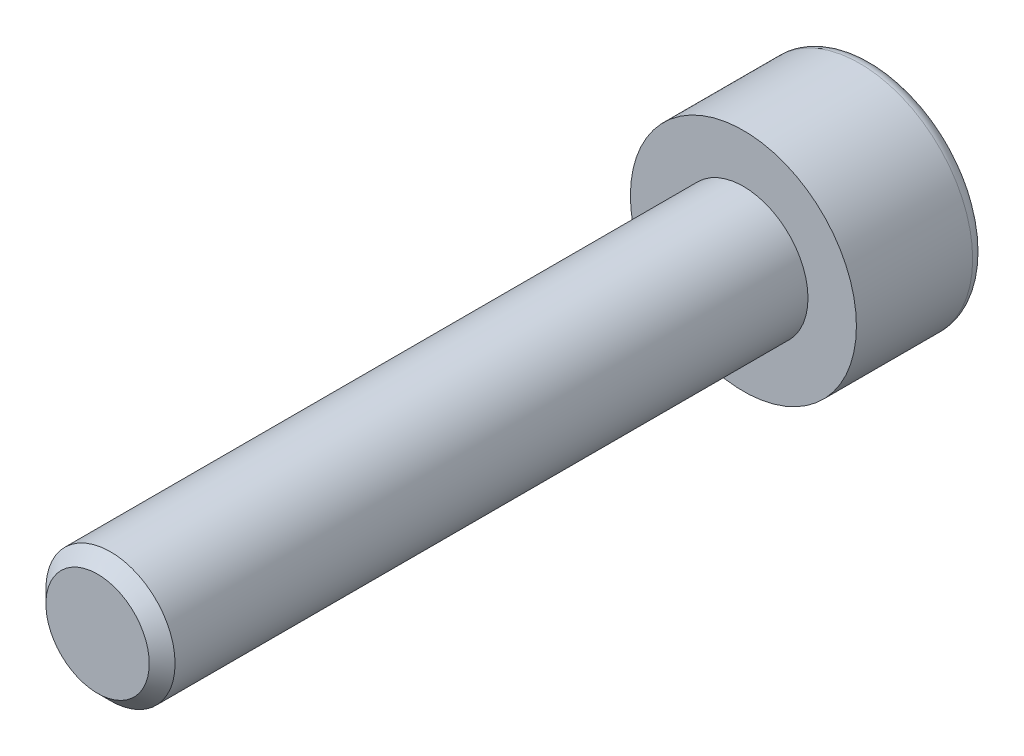
ISO-10303-21;
HEADER;
FILE_DESCRIPTION(('STEP AP214'),'2;1');
FILE_NAME('part.step','',(''),(''),'','','');
FILE_SCHEMA(('AUTOMOTIVE_DESIGN { 1 0 10303 214 1 1 1 1 }'));
ENDSEC;
DATA;
#1=APPLICATION_CONTEXT('core data for automotive mechanical design processes');
#2=APPLICATION_PROTOCOL_DEFINITION('international standard','automotive_design',2000,#1);
#3=PRODUCT_CONTEXT('',#1,'mechanical');
#4=PRODUCT('Part','Part','',(#3));
#5=PRODUCT_RELATED_PRODUCT_CATEGORY('part','',(#4));
#6=PRODUCT_DEFINITION_FORMATION('','',#4);
#7=PRODUCT_DEFINITION_CONTEXT('part definition',#1,'design');
#8=PRODUCT_DEFINITION('design','',#6,#7);
#9=PRODUCT_DEFINITION_SHAPE('','',#8);
#10=(LENGTH_UNIT() NAMED_UNIT(*) SI_UNIT(.MILLI.,.METRE.));
#11=(NAMED_UNIT(*) PLANE_ANGLE_UNIT() SI_UNIT($,.RADIAN.));
#12=(NAMED_UNIT(*) SI_UNIT($,.STERADIAN.) SOLID_ANGLE_UNIT());
#13=UNCERTAINTY_MEASURE_WITH_UNIT(LENGTH_MEASURE(1.E-05),#10,'distance_accuracy_value','');
#14=(GEOMETRIC_REPRESENTATION_CONTEXT(3) GLOBAL_UNCERTAINTY_ASSIGNED_CONTEXT((#13)) GLOBAL_UNIT_ASSIGNED_CONTEXT((#10,
#11,#12)) REPRESENTATION_CONTEXT('',''));
#15=CARTESIAN_POINT('',(0.,0.,0.));
#16=DIRECTION('',(0.,0.,1.));
#17=DIRECTION('',(1.,0.,0.));
#18=AXIS2_PLACEMENT_3D('',#15,#16,#17);
#19=CARTESIAN_POINT('',(0.,0.,-4.));
#20=DIRECTION('',(0.,0.,1.));
#21=DIRECTION('',(1.,0.,0.));
#22=AXIS2_PLACEMENT_3D('',#19,#20,#21);
#23=PLANE('',#22);
#24=CARTESIAN_POINT('',(0.,0.,-4.));
#25=DIRECTION('',(0.,0.,-1.));
#26=DIRECTION('',(-1.,0.,0.));
#27=AXIS2_PLACEMENT_3D('',#24,#25,#26);
#28=CIRCLE('',#27,3.1);
#29=CARTESIAN_POINT('',(-3.1,0.,-4.));
#30=VERTEX_POINT('',#29);
#31=EDGE_CURVE('E145',#30,#30,#28,.T.);
#32=ORIENTED_EDGE('',*,*,#31,.T.);
#33=EDGE_LOOP('',(#32));
#34=FACE_BOUND('',#33,.T.);
#35=DIRECTION('',(-0.86602540378444,0.499999999999998,0.));
#36=VECTOR('',#35,1.);
#37=CARTESIAN_POINT('',(0.,1.73205080756888,-4.));
#38=LINE('',#37,#36);
#39=CARTESIAN_POINT('',(1.5,0.866025403784442,-4.));
#40=VERTEX_POINT('',#39);
#41=CARTESIAN_POINT('',(0.,1.73205080756888,-4.));
#42=VERTEX_POINT('',#41);
#43=EDGE_CURVE('E47',#40,#42,#38,.T.);
#44=ORIENTED_EDGE('',*,*,#43,.T.);
#45=DIRECTION('',(-0.866025403784437,-0.500000000000002,0.));
#46=VECTOR('',#45,1.);
#47=CARTESIAN_POINT('',(0.,1.73205080756888,-4.));
#48=LINE('',#47,#46);
#49=CARTESIAN_POINT('',(-1.5,0.866025403784442,-4.));
#50=VERTEX_POINT('',#49);
#51=EDGE_CURVE('E118',#42,#50,#48,.T.);
#52=ORIENTED_EDGE('',*,*,#51,.T.);
#53=DIRECTION('',(0.,-1.,0.));
#54=VECTOR('',#53,1.);
#55=CARTESIAN_POINT('',(-1.5,-0.866025403784442,-4.));
#56=LINE('',#55,#54);
#57=CARTESIAN_POINT('',(-1.5,-0.866025403784442,-4.));
#58=VERTEX_POINT('',#57);
#59=EDGE_CURVE('E122',#50,#58,#56,.T.);
#60=ORIENTED_EDGE('',*,*,#59,.T.);
#61=DIRECTION('',(0.866025403784437,-0.500000000000002,0.));
#62=VECTOR('',#61,1.);
#63=CARTESIAN_POINT('',(0.,-1.73205080756888,-4.));
#64=LINE('',#63,#62);
#65=CARTESIAN_POINT('',(0.,-1.73205080756888,-4.));
#66=VERTEX_POINT('',#65);
#67=EDGE_CURVE('E125',#58,#66,#64,.T.);
#68=ORIENTED_EDGE('',*,*,#67,.T.);
#69=DIRECTION('',(0.86602540378444,0.499999999999998,0.));
#70=VECTOR('',#69,1.);
#71=CARTESIAN_POINT('',(0.,-1.73205080756888,-4.));
#72=LINE('',#71,#70);
#73=CARTESIAN_POINT('',(1.5,-0.866025403784442,-4.));
#74=VERTEX_POINT('',#73);
#75=EDGE_CURVE('E108',#66,#74,#72,.T.);
#76=ORIENTED_EDGE('',*,*,#75,.T.);
#77=DIRECTION('',(0.,1.,0.));
#78=VECTOR('',#77,1.);
#79=CARTESIAN_POINT('',(1.5,-0.866025403784442,-4.));
#80=LINE('',#79,#78);
#81=EDGE_CURVE('E128',#74,#40,#80,.T.);
#82=ORIENTED_EDGE('',*,*,#81,.T.);
#83=EDGE_LOOP('',(#44,#52,#60,#68,#76,#82));
#84=FACE_BOUND('',#83,.T.);
#85=ADVANCED_FACE('F32',(#34,#84),#23,.F.);
#86=CARTESIAN_POINT('',(0.,0.,-3.6));
#87=DIRECTION('',(0.,0.,-1.));
#88=DIRECTION('',(-1.,0.,0.));
#89=AXIS2_PLACEMENT_3D('',#86,#87,#88);
#90=TOROIDAL_SURFACE('',#89,3.1,0.4);
#91=ORIENTED_EDGE('',*,*,#31,.F.);
#92=EDGE_LOOP('',(#91));
#93=FACE_BOUND('',#92,.T.);
#94=CARTESIAN_POINT('',(0.,0.,-3.6));
#95=DIRECTION('',(0.,0.,-1.));
#96=DIRECTION('',(-1.,0.,0.));
#97=AXIS2_PLACEMENT_3D('',#94,#95,#96);
#98=CIRCLE('',#97,3.5);
#99=CARTESIAN_POINT('',(-3.5,0.,-3.6));
#100=VERTEX_POINT('',#99);
#101=EDGE_CURVE('E142',#100,#100,#98,.T.);
#102=ORIENTED_EDGE('',*,*,#101,.T.);
#103=EDGE_LOOP('',(#102));
#104=FACE_BOUND('',#103,.T.);
#105=ADVANCED_FACE('F162',(#93,#104),#90,.T.);
#106=CARTESIAN_POINT('',(0.,0.,0.));
#107=DIRECTION('',(0.,0.,-1.));
#108=DIRECTION('',(-1.,0.,0.));
#109=AXIS2_PLACEMENT_3D('',#106,#107,#108);
#110=CYLINDRICAL_SURFACE('',#109,3.5);
#111=ORIENTED_EDGE('',*,*,#101,.F.);
#112=EDGE_LOOP('',(#111));
#113=FACE_BOUND('',#112,.T.);
#114=CARTESIAN_POINT('',(0.,0.,0.));
#115=DIRECTION('',(0.,0.,-1.));
#116=DIRECTION('',(-1.,0.,0.));
#117=AXIS2_PLACEMENT_3D('',#114,#115,#116);
#118=CIRCLE('',#117,3.5);
#119=CARTESIAN_POINT('',(-3.5,0.,0.));
#120=VERTEX_POINT('',#119);
#121=EDGE_CURVE('E139',#120,#120,#118,.T.);
#122=ORIENTED_EDGE('',*,*,#121,.T.);
#123=EDGE_LOOP('',(#122));
#124=FACE_BOUND('',#123,.T.);
#125=ADVANCED_FACE('F167',(#113,#124),#110,.T.);
#126=CARTESIAN_POINT('',(0.,0.,0.));
#127=DIRECTION('',(0.,0.,-1.));
#128=DIRECTION('',(-1.,0.,0.));
#129=AXIS2_PLACEMENT_3D('',#126,#127,#128);
#130=PLANE('',#129);
#131=CARTESIAN_POINT('',(0.,0.,0.));
#132=DIRECTION('',(0.,0.,1.));
#133=DIRECTION('',(1.,0.,0.));
#134=AXIS2_PLACEMENT_3D('',#131,#132,#133);
#135=CIRCLE('',#134,2.);
#136=CARTESIAN_POINT('',(2.,0.,0.));
#137=VERTEX_POINT('',#136);
#138=EDGE_CURVE('E119',#137,#137,#135,.T.);
#139=ORIENTED_EDGE('',*,*,#138,.F.);
#140=EDGE_LOOP('',(#139));
#141=FACE_BOUND('',#140,.T.);
#142=ORIENTED_EDGE('',*,*,#121,.F.);
#143=EDGE_LOOP('',(#142));
#144=FACE_BOUND('',#143,.T.);
#145=ADVANCED_FACE('F174',(#141,#144),#130,.F.);
#146=CARTESIAN_POINT('',(0.,1.73205080756888,-2.));
#147=DIRECTION('',(-0.499999999999998,-0.86602540378444,0.));
#148=DIRECTION('',(0.86602540378444,-0.499999999999998,0.));
#149=AXIS2_PLACEMENT_3D('',#146,#147,#148);
#150=PLANE('',#149);
#151=ORIENTED_EDGE('',*,*,#43,.F.);
#152=DIRECTION('',(0.,0.,-1.));
#153=VECTOR('',#152,1.);
#154=CARTESIAN_POINT('',(1.5,0.866025403784442,-2.));
#155=LINE('',#154,#153);
#156=CARTESIAN_POINT('',(1.5,0.866025403784442,-2.));
#157=VERTEX_POINT('',#156);
#158=EDGE_CURVE('E113',#157,#40,#155,.T.);
#159=ORIENTED_EDGE('',*,*,#158,.F.);
#160=DIRECTION('',(-0.86602540378444,0.499999999999998,0.));
#161=VECTOR('',#160,1.);
#162=CARTESIAN_POINT('',(0.,1.73205080756888,-2.));
#163=LINE('',#162,#161);
#164=CARTESIAN_POINT('',(0.,1.73205080756888,-2.));
#165=VERTEX_POINT('',#164);
#166=EDGE_CURVE('E131',#157,#165,#163,.T.);
#167=ORIENTED_EDGE('',*,*,#166,.T.);
#168=DIRECTION('',(0.,0.,-1.));
#169=VECTOR('',#168,1.);
#170=CARTESIAN_POINT('',(0.,1.73205080756888,-2.));
#171=LINE('',#170,#169);
#172=EDGE_CURVE('E137',#165,#42,#171,.T.);
#173=ORIENTED_EDGE('',*,*,#172,.T.);
#174=EDGE_LOOP('',(#151,#159,#167,#173));
#175=FACE_BOUND('',#174,.T.);
#176=ADVANCED_FACE('F178',(#175),#150,.T.);
#177=CARTESIAN_POINT('',(0.,1.73205080756888,-2.));
#178=DIRECTION('',(0.500000000000002,-0.866025403784438,0.));
#179=DIRECTION('',(0.866025403784438,0.500000000000002,0.));
#180=AXIS2_PLACEMENT_3D('',#177,#178,#179);
#181=PLANE('',#180);
#182=ORIENTED_EDGE('',*,*,#51,.F.);
#183=ORIENTED_EDGE('',*,*,#172,.F.);
#184=DIRECTION('',(-0.866025403784437,-0.500000000000002,0.));
#185=VECTOR('',#184,1.);
#186=CARTESIAN_POINT('',(0.,1.73205080756888,-2.));
#187=LINE('',#186,#185);
#188=CARTESIAN_POINT('',(-1.5,0.866025403784442,-2.));
#189=VERTEX_POINT('',#188);
#190=EDGE_CURVE('E86',#165,#189,#187,.T.);
#191=ORIENTED_EDGE('',*,*,#190,.T.);
#192=DIRECTION('',(0.,0.,-1.));
#193=VECTOR('',#192,1.);
#194=CARTESIAN_POINT('',(-1.5,0.866025403784442,-2.));
#195=LINE('',#194,#193);
#196=EDGE_CURVE('E135',#189,#50,#195,.T.);
#197=ORIENTED_EDGE('',*,*,#196,.T.);
#198=EDGE_LOOP('',(#182,#183,#191,#197));
#199=FACE_BOUND('',#198,.T.);
#200=ADVANCED_FACE('F182',(#199),#181,.T.);
#201=CARTESIAN_POINT('',(-1.5,-0.866025403784442,-2.));
#202=DIRECTION('',(1.,0.,0.));
#203=DIRECTION('',(0.,0.,-1.));
#204=AXIS2_PLACEMENT_3D('',#201,#202,#203);
#205=PLANE('',#204);
#206=ORIENTED_EDGE('',*,*,#59,.F.);
#207=ORIENTED_EDGE('',*,*,#196,.F.);
#208=DIRECTION('',(0.,-1.,0.));
#209=VECTOR('',#208,1.);
#210=CARTESIAN_POINT('',(-1.5,-0.866025403784442,-2.));
#211=LINE('',#210,#209);
#212=CARTESIAN_POINT('',(-1.5,-0.866025403784442,-2.));
#213=VERTEX_POINT('',#212);
#214=EDGE_CURVE('E104',#189,#213,#211,.T.);
#215=ORIENTED_EDGE('',*,*,#214,.T.);
#216=DIRECTION('',(0.,0.,-1.));
#217=VECTOR('',#216,1.);
#218=CARTESIAN_POINT('',(-1.5,-0.866025403784442,-2.));
#219=LINE('',#218,#217);
#220=EDGE_CURVE('E101',#213,#58,#219,.T.);
#221=ORIENTED_EDGE('',*,*,#220,.T.);
#222=EDGE_LOOP('',(#206,#207,#215,#221));
#223=FACE_BOUND('',#222,.T.);
#224=ADVANCED_FACE('F185',(#223),#205,.T.);
#225=CARTESIAN_POINT('',(0.,-1.73205080756888,-2.));
#226=DIRECTION('',(0.500000000000002,0.866025403784438,0.));
#227=DIRECTION('',(-0.866025403784438,0.500000000000002,0.));
#228=AXIS2_PLACEMENT_3D('',#225,#226,#227);
#229=PLANE('',#228);
#230=ORIENTED_EDGE('',*,*,#67,.F.);
#231=ORIENTED_EDGE('',*,*,#220,.F.);
#232=DIRECTION('',(0.866025403784437,-0.500000000000002,0.));
#233=VECTOR('',#232,1.);
#234=CARTESIAN_POINT('',(0.,-1.73205080756888,-2.));
#235=LINE('',#234,#233);
#236=CARTESIAN_POINT('',(0.,-1.73205080756888,-2.));
#237=VERTEX_POINT('',#236);
#238=EDGE_CURVE('E96',#213,#237,#235,.T.);
#239=ORIENTED_EDGE('',*,*,#238,.T.);
#240=DIRECTION('',(0.,0.,-1.));
#241=VECTOR('',#240,1.);
#242=CARTESIAN_POINT('',(0.,-1.73205080756888,-2.));
#243=LINE('',#242,#241);
#244=EDGE_CURVE('E100',#237,#66,#243,.T.);
#245=ORIENTED_EDGE('',*,*,#244,.T.);
#246=EDGE_LOOP('',(#230,#231,#239,#245));
#247=FACE_BOUND('',#246,.T.);
#248=ADVANCED_FACE('F99',(#247),#229,.T.);
#249=CARTESIAN_POINT('',(0.,-1.73205080756888,-2.));
#250=DIRECTION('',(-0.499999999999998,0.86602540378444,0.));
#251=DIRECTION('',(-0.86602540378444,-0.499999999999998,0.));
#252=AXIS2_PLACEMENT_3D('',#249,#250,#251);
#253=PLANE('',#252);
#254=ORIENTED_EDGE('',*,*,#75,.F.);
#255=ORIENTED_EDGE('',*,*,#244,.F.);
#256=DIRECTION('',(0.86602540378444,0.499999999999998,0.));
#257=VECTOR('',#256,1.);
#258=CARTESIAN_POINT('',(0.,-1.73205080756888,-2.));
#259=LINE('',#258,#257);
#260=CARTESIAN_POINT('',(1.5,-0.866025403784442,-2.));
#261=VERTEX_POINT('',#260);
#262=EDGE_CURVE('E103',#237,#261,#259,.T.);
#263=ORIENTED_EDGE('',*,*,#262,.T.);
#264=DIRECTION('',(0.,0.,-1.));
#265=VECTOR('',#264,1.);
#266=CARTESIAN_POINT('',(1.5,-0.866025403784442,-2.));
#267=LINE('',#266,#265);
#268=EDGE_CURVE('E77',#261,#74,#267,.T.);
#269=ORIENTED_EDGE('',*,*,#268,.T.);
#270=EDGE_LOOP('',(#254,#255,#263,#269));
#271=FACE_BOUND('',#270,.T.);
#272=ADVANCED_FACE('F106',(#271),#253,.T.);
#273=CARTESIAN_POINT('',(1.5,-0.866025403784442,-2.));
#274=DIRECTION('',(-1.,0.,0.));
#275=DIRECTION('',(0.,0.,1.));
#276=AXIS2_PLACEMENT_3D('',#273,#274,#275);
#277=PLANE('',#276);
#278=ORIENTED_EDGE('',*,*,#81,.F.);
#279=ORIENTED_EDGE('',*,*,#268,.F.);
#280=DIRECTION('',(0.,1.,0.));
#281=VECTOR('',#280,1.);
#282=CARTESIAN_POINT('',(1.5,-0.866025403784442,-2.));
#283=LINE('',#282,#281);
#284=EDGE_CURVE('E55',#261,#157,#283,.T.);
#285=ORIENTED_EDGE('',*,*,#284,.T.);
#286=ORIENTED_EDGE('',*,*,#158,.T.);
#287=EDGE_LOOP('',(#278,#279,#285,#286));
#288=FACE_BOUND('',#287,.T.);
#289=ADVANCED_FACE('F194',(#288),#277,.T.);
#290=CARTESIAN_POINT('',(1.5,0.866025403784442,-2.));
#291=DIRECTION('',(0.,0.,1.));
#292=DIRECTION('',(1.,0.,0.));
#293=AXIS2_PLACEMENT_3D('',#290,#291,#292);
#294=PLANE('',#293);
#295=ORIENTED_EDGE('',*,*,#166,.F.);
#296=ORIENTED_EDGE('',*,*,#284,.F.);
#297=ORIENTED_EDGE('',*,*,#262,.F.);
#298=ORIENTED_EDGE('',*,*,#238,.F.);
#299=ORIENTED_EDGE('',*,*,#214,.F.);
#300=ORIENTED_EDGE('',*,*,#190,.F.);
#301=EDGE_LOOP('',(#295,#296,#297,#298,#299,#300));
#302=FACE_BOUND('',#301,.T.);
#303=ADVANCED_FACE('F111',(#302),#294,.F.);
#304=CARTESIAN_POINT('',(0.,0.,20.));
#305=DIRECTION('',(0.,0.,1.));
#306=DIRECTION('',(1.,0.,0.));
#307=AXIS2_PLACEMENT_3D('',#304,#305,#306);
#308=PLANE('',#307);
#309=CARTESIAN_POINT('',(0.,0.,20.));
#310=DIRECTION('',(0.,0.,1.));
#311=DIRECTION('',(1.,0.,0.));
#312=AXIS2_PLACEMENT_3D('',#309,#310,#311);
#313=CIRCLE('',#312,1.6);
#314=CARTESIAN_POINT('',(1.6,0.,20.));
#315=VERTEX_POINT('',#314);
#316=EDGE_CURVE('E40',#315,#315,#313,.T.);
#317=ORIENTED_EDGE('',*,*,#316,.T.);
#318=EDGE_LOOP('',(#317));
#319=FACE_BOUND('',#318,.T.);
#320=ADVANCED_FACE('F150',(#319),#308,.T.);
#321=CARTESIAN_POINT('',(0.,0.,0.));
#322=DIRECTION('',(0.,0.,1.));
#323=DIRECTION('',(1.,0.,0.));
#324=AXIS2_PLACEMENT_3D('',#321,#322,#323);
#325=CYLINDRICAL_SURFACE('',#324,2.);
#326=CARTESIAN_POINT('',(0.,0.,19.6));
#327=DIRECTION('',(0.,0.,1.));
#328=DIRECTION('',(1.,0.,0.));
#329=AXIS2_PLACEMENT_3D('',#326,#327,#328);
#330=CIRCLE('',#329,2.);
#331=CARTESIAN_POINT('',(2.,0.,19.6));
#332=VERTEX_POINT('',#331);
#333=EDGE_CURVE('E11',#332,#332,#330,.F.);
#334=ORIENTED_EDGE('',*,*,#333,.T.);
#335=EDGE_LOOP('',(#334));
#336=FACE_BOUND('',#335,.T.);
#337=ORIENTED_EDGE('',*,*,#138,.T.);
#338=EDGE_LOOP('',(#337));
#339=FACE_BOUND('',#338,.T.);
#340=ADVANCED_FACE('F153',(#336,#339),#325,.T.);
#341=CARTESIAN_POINT('',(0.,0.,20.));
#342=DIRECTION('',(0.,0.,-1.));
#343=DIRECTION('',(-1.,0.,0.));
#344=AXIS2_PLACEMENT_3D('',#341,#342,#343);
#345=CONICAL_SURFACE('',#344,1.6,0.785398163397449);
#346=ORIENTED_EDGE('',*,*,#333,.F.);
#347=EDGE_LOOP('',(#346));
#348=FACE_BOUND('',#347,.T.);
#349=ORIENTED_EDGE('',*,*,#316,.F.);
#350=EDGE_LOOP('',(#349));
#351=FACE_BOUND('',#350,.T.);
#352=ADVANCED_FACE('F34',(#348,#351),#345,.T.);
#353=CLOSED_SHELL('',(#85,#105,#125,#145,#176,#200,#224,#248,#272,#289,#303,#320,#340,#352));
#354=MANIFOLD_SOLID_BREP('B2',#353);
#355=ADVANCED_BREP_SHAPE_REPRESENTATION('',(#18,#354),#14);
#356=SHAPE_DEFINITION_REPRESENTATION(#9,#355);
ENDSEC;
END-ISO-10303-21;
